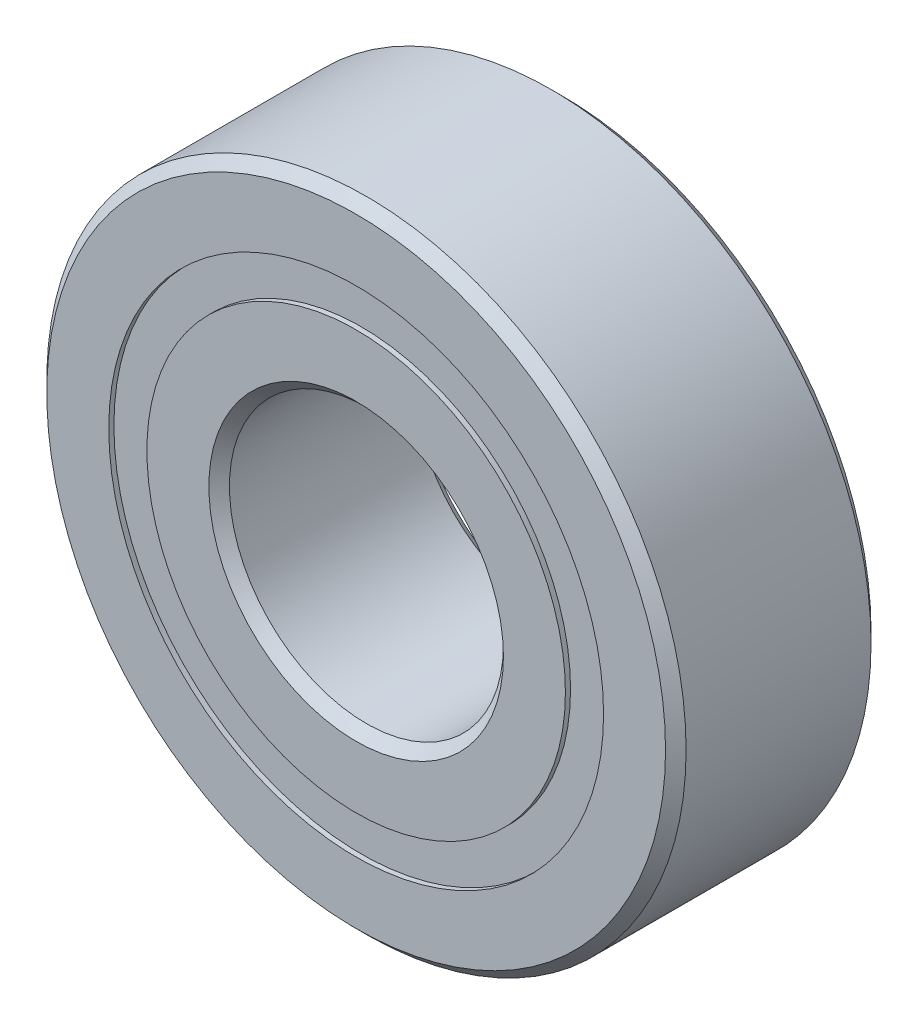
ISO-10303-21;
HEADER;
FILE_DESCRIPTION(('STEP AP214'),'2;1');
FILE_NAME('part.step','',(''),(''),'','','');
FILE_SCHEMA(('AUTOMOTIVE_DESIGN { 1 0 10303 214 1 1 1 1 }'));
ENDSEC;
DATA;
#1=APPLICATION_CONTEXT('core data for automotive mechanical design processes');
#2=APPLICATION_PROTOCOL_DEFINITION('international standard','automotive_design',2000,#1);
#3=PRODUCT_CONTEXT('',#1,'mechanical');
#4=PRODUCT('Part','Part','',(#3));
#5=PRODUCT_RELATED_PRODUCT_CATEGORY('part','',(#4));
#6=PRODUCT_DEFINITION_FORMATION('','',#4);
#7=PRODUCT_DEFINITION_CONTEXT('part definition',#1,'design');
#8=PRODUCT_DEFINITION('design','',#6,#7);
#9=PRODUCT_DEFINITION_SHAPE('','',#8);
#10=(LENGTH_UNIT() NAMED_UNIT(*) SI_UNIT(.MILLI.,.METRE.));
#11=(NAMED_UNIT(*) PLANE_ANGLE_UNIT() SI_UNIT($,.RADIAN.));
#12=(NAMED_UNIT(*) SI_UNIT($,.STERADIAN.) SOLID_ANGLE_UNIT());
#13=UNCERTAINTY_MEASURE_WITH_UNIT(LENGTH_MEASURE(1.E-05),#10,'distance_accuracy_value','');
#14=(GEOMETRIC_REPRESENTATION_CONTEXT(3) GLOBAL_UNCERTAINTY_ASSIGNED_CONTEXT((#13)) GLOBAL_UNIT_ASSIGNED_CONTEXT((#10,
#11,#12)) REPRESENTATION_CONTEXT('',''));
#15=CARTESIAN_POINT('',(0.,0.,0.));
#16=DIRECTION('',(0.,0.,1.));
#17=DIRECTION('',(1.,0.,0.));
#18=AXIS2_PLACEMENT_3D('',#15,#16,#17);
#19=CARTESIAN_POINT('',(0.,8.60041208791209,-3.39328125));
#20=DIRECTION('',(0.,0.,1.));
#21=DIRECTION('',(1.,0.,0.));
#22=AXIS2_PLACEMENT_3D('',#19,#20,#21);
#23=PLANE('',#22);
#24=CARTESIAN_POINT('',(0.,0.,-3.39328125));
#25=DIRECTION('',(0.,0.,1.));
#26=DIRECTION('',(1.,0.,0.));
#27=AXIS2_PLACEMENT_3D('',#24,#25,#26);
#28=CIRCLE('',#27,8.60041208791209);
#29=CARTESIAN_POINT('',(8.60041208791209,0.,-3.39328125));
#30=VERTEX_POINT('',#29);
#31=EDGE_CURVE('E59',#30,#30,#28,.T.);
#32=ORIENTED_EDGE('',*,*,#31,.F.);
#33=EDGE_LOOP('',(#32));
#34=FACE_BOUND('',#33,.T.);
#35=CARTESIAN_POINT('',(0.,0.,-3.39328125));
#36=DIRECTION('',(0.,0.,1.));
#37=DIRECTION('',(1.,0.,0.));
#38=AXIS2_PLACEMENT_3D('',#35,#36,#37);
#39=CIRCLE('',#38,7.27458791208791);
#40=CARTESIAN_POINT('',(7.27458791208791,0.,-3.39328125));
#41=VERTEX_POINT('',#40);
#42=EDGE_CURVE('E11',#41,#41,#39,.T.);
#43=ORIENTED_EDGE('',*,*,#42,.T.);
#44=EDGE_LOOP('',(#43));
#45=FACE_BOUND('',#44,.T.);
#46=ADVANCED_FACE('F45',(#34,#45),#23,.F.);
#47=CARTESIAN_POINT('',(0.,0.,3.571875));
#48=DIRECTION('',(0.,0.,1.));
#49=DIRECTION('',(1.,0.,0.));
#50=AXIS2_PLACEMENT_3D('',#47,#48,#49);
#51=CYLINDRICAL_SURFACE('',#50,7.27458791208791);
#52=ORIENTED_EDGE('',*,*,#42,.F.);
#53=EDGE_LOOP('',(#52));
#54=FACE_BOUND('',#53,.T.);
#55=CARTESIAN_POINT('',(0.,0.,-1.72035132641562));
#56=DIRECTION('',(0.,0.,1.));
#57=DIRECTION('',(1.,0.,0.));
#58=AXIS2_PLACEMENT_3D('',#55,#56,#57);
#59=CIRCLE('',#58,7.27458791208791);
#60=CARTESIAN_POINT('',(7.27458791208791,0.,-1.72035132641562));
#61=VERTEX_POINT('',#60);
#62=EDGE_CURVE('E51',#61,#61,#59,.T.);
#63=ORIENTED_EDGE('',*,*,#62,.T.);
#64=EDGE_LOOP('',(#63));
#65=FACE_BOUND('',#64,.T.);
#66=ADVANCED_FACE('F68',(#54,#65),#51,.F.);
#67=CARTESIAN_POINT('',(0.,8.60041208791209,-1.72035132641562));
#68=DIRECTION('',(0.,0.,-1.));
#69=DIRECTION('',(-1.,0.,0.));
#70=AXIS2_PLACEMENT_3D('',#67,#68,#69);
#71=PLANE('',#70);
#72=ORIENTED_EDGE('',*,*,#62,.F.);
#73=EDGE_LOOP('',(#72));
#74=FACE_BOUND('',#73,.T.);
#75=CARTESIAN_POINT('',(0.,0.,-1.72035132641562));
#76=DIRECTION('',(0.,0.,1.));
#77=DIRECTION('',(1.,0.,0.));
#78=AXIS2_PLACEMENT_3D('',#75,#76,#77);
#79=CIRCLE('',#78,8.60041208791209);
#80=CARTESIAN_POINT('',(8.60041208791209,0.,-1.72035132641562));
#81=VERTEX_POINT('',#80);
#82=EDGE_CURVE('E55',#81,#81,#79,.T.);
#83=ORIENTED_EDGE('',*,*,#82,.T.);
#84=EDGE_LOOP('',(#83));
#85=FACE_BOUND('',#84,.T.);
#86=ADVANCED_FACE('F72',(#74,#85),#71,.F.);
#87=CARTESIAN_POINT('',(0.,0.,3.571875));
#88=DIRECTION('',(0.,0.,1.));
#89=DIRECTION('',(1.,0.,0.));
#90=AXIS2_PLACEMENT_3D('',#87,#88,#89);
#91=CYLINDRICAL_SURFACE('',#90,8.60041208791209);
#92=ORIENTED_EDGE('',*,*,#82,.F.);
#93=EDGE_LOOP('',(#92));
#94=FACE_BOUND('',#93,.T.);
#95=ORIENTED_EDGE('',*,*,#31,.T.);
#96=EDGE_LOOP('',(#95));
#97=FACE_BOUND('',#96,.T.);
#98=ADVANCED_FACE('F65',(#94,#97),#91,.T.);
#99=CLOSED_SHELL('',(#46,#66,#86,#98));
#100=MANIFOLD_SOLID_BREP('B2',#99);
#101=CARTESIAN_POINT('',(0.,8.60041208791209,3.39328125));
#102=DIRECTION('',(0.,0.,-1.));
#103=DIRECTION('',(-1.,0.,0.));
#104=AXIS2_PLACEMENT_3D('',#101,#102,#103);
#105=PLANE('',#104);
#106=CARTESIAN_POINT('',(0.,0.,3.39328125));
#107=DIRECTION('',(0.,0.,1.));
#108=DIRECTION('',(1.,0.,0.));
#109=AXIS2_PLACEMENT_3D('',#106,#107,#108);
#110=CIRCLE('',#109,7.27458791208791);
#111=CARTESIAN_POINT('',(7.27458791208791,0.,3.39328125));
#112=VERTEX_POINT('',#111);
#113=EDGE_CURVE('E44',#112,#112,#110,.T.);
#114=ORIENTED_EDGE('',*,*,#113,.F.);
#115=EDGE_LOOP('',(#114));
#116=FACE_BOUND('',#115,.T.);
#117=CARTESIAN_POINT('',(0.,0.,3.39328125));
#118=DIRECTION('',(0.,0.,1.));
#119=DIRECTION('',(1.,0.,0.));
#120=AXIS2_PLACEMENT_3D('',#117,#118,#119);
#121=CIRCLE('',#120,8.60041208791209);
#122=CARTESIAN_POINT('',(8.60041208791209,0.,3.39328125));
#123=VERTEX_POINT('',#122);
#124=EDGE_CURVE('E126',#123,#123,#121,.T.);
#125=ORIENTED_EDGE('',*,*,#124,.T.);
#126=EDGE_LOOP('',(#125));
#127=FACE_BOUND('',#126,.T.);
#128=ADVANCED_FACE('F112',(#116,#127),#105,.F.);
#129=CARTESIAN_POINT('',(0.,0.,3.571875));
#130=DIRECTION('',(0.,0.,1.));
#131=DIRECTION('',(1.,0.,0.));
#132=AXIS2_PLACEMENT_3D('',#129,#130,#131);
#133=CYLINDRICAL_SURFACE('',#132,7.27458791208791);
#134=CARTESIAN_POINT('',(0.,0.,1.72035132641561));
#135=DIRECTION('',(0.,0.,1.));
#136=DIRECTION('',(1.,0.,0.));
#137=AXIS2_PLACEMENT_3D('',#134,#135,#136);
#138=CIRCLE('',#137,7.27458791208791);
#139=CARTESIAN_POINT('',(7.27458791208791,0.,1.72035132641561));
#140=VERTEX_POINT('',#139);
#141=EDGE_CURVE('E118',#140,#140,#138,.T.);
#142=ORIENTED_EDGE('',*,*,#141,.F.);
#143=EDGE_LOOP('',(#142));
#144=FACE_BOUND('',#143,.T.);
#145=ORIENTED_EDGE('',*,*,#113,.T.);
#146=EDGE_LOOP('',(#145));
#147=FACE_BOUND('',#146,.T.);
#148=ADVANCED_FACE('F141',(#144,#147),#133,.F.);
#149=CARTESIAN_POINT('',(0.,8.60041208791209,1.72035132641561));
#150=DIRECTION('',(0.,0.,1.));
#151=DIRECTION('',(1.,0.,0.));
#152=AXIS2_PLACEMENT_3D('',#149,#150,#151);
#153=PLANE('',#152);
#154=CARTESIAN_POINT('',(0.,0.,1.72035132641561));
#155=DIRECTION('',(0.,0.,1.));
#156=DIRECTION('',(1.,0.,0.));
#157=AXIS2_PLACEMENT_3D('',#154,#155,#156);
#158=CIRCLE('',#157,8.60041208791209);
#159=CARTESIAN_POINT('',(8.60041208791209,0.,1.72035132641561));
#160=VERTEX_POINT('',#159);
#161=EDGE_CURVE('E122',#160,#160,#158,.T.);
#162=ORIENTED_EDGE('',*,*,#161,.F.);
#163=EDGE_LOOP('',(#162));
#164=FACE_BOUND('',#163,.T.);
#165=ORIENTED_EDGE('',*,*,#141,.T.);
#166=EDGE_LOOP('',(#165));
#167=FACE_BOUND('',#166,.T.);
#168=ADVANCED_FACE('F136',(#164,#167),#153,.F.);
#169=CARTESIAN_POINT('',(0.,0.,3.571875));
#170=DIRECTION('',(0.,0.,1.));
#171=DIRECTION('',(1.,0.,0.));
#172=AXIS2_PLACEMENT_3D('',#169,#170,#171);
#173=CYLINDRICAL_SURFACE('',#172,8.60041208791209);
#174=ORIENTED_EDGE('',*,*,#124,.F.);
#175=EDGE_LOOP('',(#174));
#176=FACE_BOUND('',#175,.T.);
#177=ORIENTED_EDGE('',*,*,#161,.T.);
#178=EDGE_LOOP('',(#177));
#179=FACE_BOUND('',#178,.T.);
#180=ADVANCED_FACE('F133',(#176,#179),#173,.T.);
#181=CLOSED_SHELL('',(#128,#148,#168,#180));
#182=MANIFOLD_SOLID_BREP('B6',#181);
#183=CARTESIAN_POINT('',(-4.66554544007142,6.42157239285121,0.));
#184=DIRECTION('',(0.,0.,1.));
#185=DIRECTION('',(-0.587785252292462,0.809016994374955,0.));
#186=AXIS2_PLACEMENT_3D('',#183,#184,#185);
#187=SPHERICAL_SURFACE('',#186,1.72035132641561);
#188=CARTESIAN_POINT('',(-4.66554544007142,6.42157239285121,1.72035132641561));
#189=VERTEX_POINT('',#188);
#190=VERTEX_LOOP('',#189);
#191=FACE_BOUND('',#190,.T.);
#192=ADVANCED_FACE('F179',(#191),#187,.T.);
#193=CLOSED_SHELL('',(#192));
#194=MANIFOLD_SOLID_BREP('B39',#193);
#195=CARTESIAN_POINT('',(-7.54901109809275,2.45282239285123,0.));
#196=DIRECTION('',(0.,0.,1.));
#197=DIRECTION('',(-0.95105651629515,0.309016994374958,0.));
#198=AXIS2_PLACEMENT_3D('',#195,#196,#197);
#199=SPHERICAL_SURFACE('',#198,1.72035132641561);
#200=CARTESIAN_POINT('',(-7.54901109809275,2.45282239285123,1.72035132641561));
#201=VERTEX_POINT('',#200);
#202=VERTEX_LOOP('',#201);
#203=FACE_BOUND('',#202,.T.);
#204=ADVANCED_FACE('F199',(#203),#199,.T.);
#205=CLOSED_SHELL('',(#204));
#206=MANIFOLD_SOLID_BREP('B108',#205);
#207=CARTESIAN_POINT('',(-7.54901109809281,-2.45282239285107,0.));
#208=DIRECTION('',(0.,0.,1.));
#209=DIRECTION('',(-0.951056516295157,-0.309016994374938,0.));
#210=AXIS2_PLACEMENT_3D('',#207,#208,#209);
#211=SPHERICAL_SURFACE('',#210,1.72035132641561);
#212=CARTESIAN_POINT('',(-7.54901109809281,-2.45282239285107,1.72035132641561));
#213=VERTEX_POINT('',#212);
#214=VERTEX_LOOP('',#213);
#215=FACE_BOUND('',#214,.T.);
#216=ADVANCED_FACE('F219',(#215),#211,.T.);
#217=CLOSED_SHELL('',(#216));
#218=MANIFOLD_SOLID_BREP('B175',#217);
#219=CARTESIAN_POINT('',(-4.66554544007156,-6.4215723928511,0.));
#220=DIRECTION('',(0.,0.,1.));
#221=DIRECTION('',(-0.58778525229248,-0.809016994374942,0.));
#222=AXIS2_PLACEMENT_3D('',#219,#220,#221);
#223=SPHERICAL_SURFACE('',#222,1.72035132641561);
#224=CARTESIAN_POINT('',(-4.66554544007156,-6.4215723928511,1.72035132641561));
#225=VERTEX_POINT('',#224);
#226=VERTEX_LOOP('',#225);
#227=FACE_BOUND('',#226,.T.);
#228=ADVANCED_FACE('F239',(#227),#223,.T.);
#229=CLOSED_SHELL('',(#228));
#230=MANIFOLD_SOLID_BREP('B195',#229);
#231=CARTESIAN_POINT('',(0.,-7.9375,0.));
#232=DIRECTION('',(0.,0.,1.));
#233=DIRECTION('',(0.,-1.,0.));
#234=AXIS2_PLACEMENT_3D('',#231,#232,#233);
#235=SPHERICAL_SURFACE('',#234,1.72035132641561);
#236=CARTESIAN_POINT('',(0.,-7.9375,1.72035132641561));
#237=VERTEX_POINT('',#236);
#238=VERTEX_LOOP('',#237);
#239=FACE_BOUND('',#238,.T.);
#240=ADVANCED_FACE('F259',(#239),#235,.T.);
#241=CLOSED_SHELL('',(#240));
#242=MANIFOLD_SOLID_BREP('B215',#241);
#243=CARTESIAN_POINT('',(4.66554544007147,-6.42157239285117,0.));
#244=DIRECTION('',(0.,0.,1.));
#245=DIRECTION('',(0.587785252292469,-0.809016994374951,0.));
#246=AXIS2_PLACEMENT_3D('',#243,#244,#245);
#247=SPHERICAL_SURFACE('',#246,1.72035132641561);
#248=CARTESIAN_POINT('',(4.66554544007147,-6.42157239285117,1.72035132641561));
#249=VERTEX_POINT('',#248);
#250=VERTEX_LOOP('',#249);
#251=FACE_BOUND('',#250,.T.);
#252=ADVANCED_FACE('F279',(#251),#247,.T.);
#253=CLOSED_SHELL('',(#252));
#254=MANIFOLD_SOLID_BREP('B235',#253);
#255=CARTESIAN_POINT('',(7.54901109809277,-2.45282239285118,0.));
#256=DIRECTION('',(0.,0.,1.));
#257=DIRECTION('',(0.951056516295152,-0.309016994374952,0.));
#258=AXIS2_PLACEMENT_3D('',#255,#256,#257);
#259=SPHERICAL_SURFACE('',#258,1.72035132641561);
#260=CARTESIAN_POINT('',(7.54901109809277,-2.45282239285118,1.72035132641561));
#261=VERTEX_POINT('',#260);
#262=VERTEX_LOOP('',#261);
#263=FACE_BOUND('',#262,.T.);
#264=ADVANCED_FACE('F299',(#263),#259,.T.);
#265=CLOSED_SHELL('',(#264));
#266=MANIFOLD_SOLID_BREP('B255',#265);
#267=CARTESIAN_POINT('',(7.54901109809279,2.45282239285112,0.));
#268=DIRECTION('',(0.,0.,1.));
#269=DIRECTION('',(0.951056516295155,0.309016994374945,0.));
#270=AXIS2_PLACEMENT_3D('',#267,#268,#269);
#271=SPHERICAL_SURFACE('',#270,1.72035132641561);
#272=CARTESIAN_POINT('',(7.54901109809279,2.45282239285112,1.72035132641561));
#273=VERTEX_POINT('',#272);
#274=VERTEX_LOOP('',#273);
#275=FACE_BOUND('',#274,.T.);
#276=ADVANCED_FACE('F319',(#275),#271,.T.);
#277=CLOSED_SHELL('',(#276));
#278=MANIFOLD_SOLID_BREP('B275',#277);
#279=CARTESIAN_POINT('',(4.66554544007152,6.42157239285114,0.));
#280=DIRECTION('',(0.,0.,1.));
#281=DIRECTION('',(0.587785252292474,0.809016994374947,0.));
#282=AXIS2_PLACEMENT_3D('',#279,#280,#281);
#283=SPHERICAL_SURFACE('',#282,1.72035132641561);
#284=CARTESIAN_POINT('',(4.66554544007152,6.42157239285114,1.72035132641561));
#285=VERTEX_POINT('',#284);
#286=VERTEX_LOOP('',#285);
#287=FACE_BOUND('',#286,.T.);
#288=ADVANCED_FACE('F339',(#287),#283,.T.);
#289=CLOSED_SHELL('',(#288));
#290=MANIFOLD_SOLID_BREP('B295',#289);
#291=CARTESIAN_POINT('',(0.,7.9375,0.));
#292=DIRECTION('',(0.,0.,1.));
#293=DIRECTION('',(0.,1.,0.));
#294=AXIS2_PLACEMENT_3D('',#291,#292,#293);
#295=SPHERICAL_SURFACE('',#294,1.72035132641561);
#296=CARTESIAN_POINT('',(0.,7.9375,1.72035132641561));
#297=VERTEX_POINT('',#296);
#298=VERTEX_LOOP('',#297);
#299=FACE_BOUND('',#298,.T.);
#300=ADVANCED_FACE('F361',(#299),#295,.T.);
#301=CLOSED_SHELL('',(#300));
#302=MANIFOLD_SOLID_BREP('B315',#301);
#303=CARTESIAN_POINT('',(0.,7.27458791208791,3.571875));
#304=DIRECTION('',(0.,0.,-1.));
#305=DIRECTION('',(-1.,0.,0.));
#306=AXIS2_PLACEMENT_3D('',#303,#304,#305);
#307=PLANE('',#306);
#308=CARTESIAN_POINT('',(0.,0.,3.571875));
#309=DIRECTION('',(0.,0.,1.));
#310=DIRECTION('',(1.,0.,0.));
#311=AXIS2_PLACEMENT_3D('',#308,#309,#310);
#312=CIRCLE('',#311,5.1196875);
#313=CARTESIAN_POINT('',(5.1196875,0.,3.571875));
#314=VERTEX_POINT('',#313);
#315=EDGE_CURVE('E408',#314,#314,#312,.T.);
#316=ORIENTED_EDGE('',*,*,#315,.F.);
#317=EDGE_LOOP('',(#316));
#318=FACE_BOUND('',#317,.T.);
#319=CARTESIAN_POINT('',(0.,0.,3.571875));
#320=DIRECTION('',(0.,0.,1.));
#321=DIRECTION('',(1.,0.,0.));
#322=AXIS2_PLACEMENT_3D('',#319,#320,#321);
#323=CIRCLE('',#322,7.27458791208791);
#324=CARTESIAN_POINT('',(7.27458791208791,0.,3.571875));
#325=VERTEX_POINT('',#324);
#326=EDGE_CURVE('E360',#325,#325,#323,.T.);
#327=ORIENTED_EDGE('',*,*,#326,.T.);
#328=EDGE_LOOP('',(#327));
#329=FACE_BOUND('',#328,.T.);
#330=ADVANCED_FACE('F380',(#318,#329),#307,.F.);
#331=CARTESIAN_POINT('',(0.,0.,3.571875));
#332=DIRECTION('',(0.,0.,1.));
#333=DIRECTION('',(1.,0.,0.));
#334=AXIS2_PLACEMENT_3D('',#331,#332,#333);
#335=CYLINDRICAL_SURFACE('',#334,7.27458791208791);
#336=ORIENTED_EDGE('',*,*,#326,.F.);
#337=EDGE_LOOP('',(#336));
#338=FACE_BOUND('',#337,.T.);
#339=CARTESIAN_POINT('',(0.,0.,1.5875));
#340=DIRECTION('',(0.,0.,1.));
#341=DIRECTION('',(1.,0.,0.));
#342=AXIS2_PLACEMENT_3D('',#339,#340,#341);
#343=CIRCLE('',#342,7.27458791208791);
#344=CARTESIAN_POINT('',(7.27458791208791,0.,1.5875));
#345=VERTEX_POINT('',#344);
#346=EDGE_CURVE('E386',#345,#345,#343,.T.);
#347=ORIENTED_EDGE('',*,*,#346,.T.);
#348=EDGE_LOOP('',(#347));
#349=FACE_BOUND('',#348,.T.);
#350=ADVANCED_FACE('F415',(#338,#349),#335,.T.);
#351=CARTESIAN_POINT('',(0.,0.,0.));
#352=DIRECTION('',(0.,0.,1.));
#353=DIRECTION('',(1.,0.,0.));
#354=AXIS2_PLACEMENT_3D('',#351,#352,#353);
#355=TOROIDAL_SURFACE('',#354,7.93749999999999,1.72035132641561);
#356=ORIENTED_EDGE('',*,*,#346,.F.);
#357=EDGE_LOOP('',(#356));
#358=FACE_BOUND('',#357,.T.);
#359=CARTESIAN_POINT('',(0.,0.,-1.5875));
#360=DIRECTION('',(0.,0.,1.));
#361=DIRECTION('',(1.,0.,0.));
#362=AXIS2_PLACEMENT_3D('',#359,#360,#361);
#363=CIRCLE('',#362,7.27458791208791);
#364=CARTESIAN_POINT('',(7.27458791208791,0.,-1.5875));
#365=VERTEX_POINT('',#364);
#366=EDGE_CURVE('E390',#365,#365,#363,.T.);
#367=ORIENTED_EDGE('',*,*,#366,.T.);
#368=EDGE_LOOP('',(#367));
#369=FACE_BOUND('',#368,.T.);
#370=ADVANCED_FACE('F419',(#358,#369),#355,.F.);
#371=CARTESIAN_POINT('',(0.,0.,3.571875));
#372=DIRECTION('',(0.,0.,1.));
#373=DIRECTION('',(1.,0.,0.));
#374=AXIS2_PLACEMENT_3D('',#371,#372,#373);
#375=CYLINDRICAL_SURFACE('',#374,7.27458791208791);
#376=ORIENTED_EDGE('',*,*,#366,.F.);
#377=EDGE_LOOP('',(#376));
#378=FACE_BOUND('',#377,.T.);
#379=CARTESIAN_POINT('',(0.,0.,-3.571875));
#380=DIRECTION('',(0.,0.,1.));
#381=DIRECTION('',(1.,0.,0.));
#382=AXIS2_PLACEMENT_3D('',#379,#380,#381);
#383=CIRCLE('',#382,7.27458791208791);
#384=CARTESIAN_POINT('',(7.27458791208791,0.,-3.571875));
#385=VERTEX_POINT('',#384);
#386=EDGE_CURVE('E394',#385,#385,#383,.T.);
#387=ORIENTED_EDGE('',*,*,#386,.T.);
#388=EDGE_LOOP('',(#387));
#389=FACE_BOUND('',#388,.T.);
#390=ADVANCED_FACE('F424',(#378,#389),#375,.T.);
#391=CARTESIAN_POINT('',(0.,5.1196875,-3.571875));
#392=DIRECTION('',(0.,0.,1.));
#393=DIRECTION('',(1.,0.,0.));
#394=AXIS2_PLACEMENT_3D('',#391,#392,#393);
#395=PLANE('',#394);
#396=ORIENTED_EDGE('',*,*,#386,.F.);
#397=EDGE_LOOP('',(#396));
#398=FACE_BOUND('',#397,.T.);
#399=CARTESIAN_POINT('',(0.,0.,-3.571875));
#400=DIRECTION('',(0.,0.,1.));
#401=DIRECTION('',(1.,0.,0.));
#402=AXIS2_PLACEMENT_3D('',#399,#400,#401);
#403=CIRCLE('',#402,5.1196875);
#404=CARTESIAN_POINT('',(5.1196875,0.,-3.571875));
#405=VERTEX_POINT('',#404);
#406=EDGE_CURVE('E399',#405,#405,#403,.T.);
#407=ORIENTED_EDGE('',*,*,#406,.T.);
#408=EDGE_LOOP('',(#407));
#409=FACE_BOUND('',#408,.T.);
#410=ADVANCED_FACE('F430',(#398,#409),#395,.F.);
#411=CARTESIAN_POINT('',(0.,0.,-3.2146875));
#412=DIRECTION('',(0.,0.,-1.));
#413=DIRECTION('',(-1.,0.,0.));
#414=AXIS2_PLACEMENT_3D('',#411,#412,#413);
#415=CONICAL_SURFACE('',#414,4.7625,0.785398163397444);
#416=ORIENTED_EDGE('',*,*,#406,.F.);
#417=EDGE_LOOP('',(#416));
#418=FACE_BOUND('',#417,.T.);
#419=CARTESIAN_POINT('',(0.,0.,-3.2146875));
#420=DIRECTION('',(0.,0.,1.));
#421=DIRECTION('',(1.,0.,0.));
#422=AXIS2_PLACEMENT_3D('',#419,#420,#421);
#423=CIRCLE('',#422,4.7625);
#424=CARTESIAN_POINT('',(4.7625,0.,-3.2146875));
#425=VERTEX_POINT('',#424);
#426=EDGE_CURVE('E402',#425,#425,#423,.T.);
#427=ORIENTED_EDGE('',*,*,#426,.T.);
#428=EDGE_LOOP('',(#427));
#429=FACE_BOUND('',#428,.T.);
#430=ADVANCED_FACE('F434',(#418,#429),#415,.F.);
#431=CARTESIAN_POINT('',(0.,0.,3.571875));
#432=DIRECTION('',(0.,0.,1.));
#433=DIRECTION('',(1.,0.,0.));
#434=AXIS2_PLACEMENT_3D('',#431,#432,#433);
#435=CYLINDRICAL_SURFACE('',#434,4.7625);
#436=ORIENTED_EDGE('',*,*,#426,.F.);
#437=EDGE_LOOP('',(#436));
#438=FACE_BOUND('',#437,.T.);
#439=CARTESIAN_POINT('',(0.,0.,3.2146875));
#440=DIRECTION('',(0.,0.,1.));
#441=DIRECTION('',(1.,0.,0.));
#442=AXIS2_PLACEMENT_3D('',#439,#440,#441);
#443=CIRCLE('',#442,4.7625);
#444=CARTESIAN_POINT('',(4.7625,0.,3.2146875));
#445=VERTEX_POINT('',#444);
#446=EDGE_CURVE('E405',#445,#445,#443,.T.);
#447=ORIENTED_EDGE('',*,*,#446,.T.);
#448=EDGE_LOOP('',(#447));
#449=FACE_BOUND('',#448,.T.);
#450=ADVANCED_FACE('F438',(#438,#449),#435,.F.);
#451=CARTESIAN_POINT('',(0.,0.,3.571875));
#452=DIRECTION('',(0.,0.,1.));
#453=DIRECTION('',(1.,0.,0.));
#454=AXIS2_PLACEMENT_3D('',#451,#452,#453);
#455=CONICAL_SURFACE('',#454,5.1196875,0.785398163397453);
#456=ORIENTED_EDGE('',*,*,#446,.F.);
#457=EDGE_LOOP('',(#456));
#458=FACE_BOUND('',#457,.T.);
#459=ORIENTED_EDGE('',*,*,#315,.T.);
#460=EDGE_LOOP('',(#459));
#461=FACE_BOUND('',#460,.T.);
#462=ADVANCED_FACE('F412',(#458,#461),#455,.F.);
#463=CLOSED_SHELL('',(#330,#350,#370,#390,#410,#430,#450,#462));
#464=MANIFOLD_SOLID_BREP('B335',#463);
#465=CARTESIAN_POINT('',(0.,0.,3.2146875));
#466=DIRECTION('',(0.,0.,-1.));
#467=DIRECTION('',(-1.,0.,0.));
#468=AXIS2_PLACEMENT_3D('',#465,#466,#467);
#469=CONICAL_SURFACE('',#468,11.1125,0.785398163397446);
#470=CARTESIAN_POINT('',(0.,0.,3.571875));
#471=DIRECTION('',(0.,0.,1.));
#472=DIRECTION('',(1.,0.,0.));
#473=AXIS2_PLACEMENT_3D('',#470,#471,#472);
#474=CIRCLE('',#473,10.7553125);
#475=CARTESIAN_POINT('',(10.7553125,0.,3.571875));
#476=VERTEX_POINT('',#475);
#477=EDGE_CURVE('E529',#476,#476,#474,.T.);
#478=ORIENTED_EDGE('',*,*,#477,.F.);
#479=EDGE_LOOP('',(#478));
#480=FACE_BOUND('',#479,.T.);
#481=CARTESIAN_POINT('',(0.,0.,3.2146875));
#482=DIRECTION('',(0.,0.,1.));
#483=DIRECTION('',(1.,0.,0.));
#484=AXIS2_PLACEMENT_3D('',#481,#482,#483);
#485=CIRCLE('',#484,11.1125);
#486=CARTESIAN_POINT('',(11.1125,0.,3.2146875));
#487=VERTEX_POINT('',#486);
#488=EDGE_CURVE('E379',#487,#487,#485,.T.);
#489=ORIENTED_EDGE('',*,*,#488,.T.);
#490=EDGE_LOOP('',(#489));
#491=FACE_BOUND('',#490,.T.);
#492=ADVANCED_FACE('F501',(#480,#491),#469,.T.);
#493=CARTESIAN_POINT('',(0.,0.,3.571875));
#494=DIRECTION('',(0.,0.,1.));
#495=DIRECTION('',(1.,0.,0.));
#496=AXIS2_PLACEMENT_3D('',#493,#494,#495);
#497=CYLINDRICAL_SURFACE('',#496,11.1125);
#498=ORIENTED_EDGE('',*,*,#488,.F.);
#499=EDGE_LOOP('',(#498));
#500=FACE_BOUND('',#499,.T.);
#501=CARTESIAN_POINT('',(0.,0.,-3.2146875));
#502=DIRECTION('',(0.,0.,1.));
#503=DIRECTION('',(1.,0.,0.));
#504=AXIS2_PLACEMENT_3D('',#501,#502,#503);
#505=CIRCLE('',#504,11.1125);
#506=CARTESIAN_POINT('',(11.1125,0.,-3.2146875));
#507=VERTEX_POINT('',#506);
#508=EDGE_CURVE('E507',#507,#507,#505,.T.);
#509=ORIENTED_EDGE('',*,*,#508,.T.);
#510=EDGE_LOOP('',(#509));
#511=FACE_BOUND('',#510,.T.);
#512=ADVANCED_FACE('F536',(#500,#511),#497,.T.);
#513=CARTESIAN_POINT('',(0.,0.,-3.571875));
#514=DIRECTION('',(0.,0.,1.));
#515=DIRECTION('',(1.,0.,0.));
#516=AXIS2_PLACEMENT_3D('',#513,#514,#515);
#517=CONICAL_SURFACE('',#516,10.7553125,0.785398163397444);
#518=ORIENTED_EDGE('',*,*,#508,.F.);
#519=EDGE_LOOP('',(#518));
#520=FACE_BOUND('',#519,.T.);
#521=CARTESIAN_POINT('',(0.,0.,-3.571875));
#522=DIRECTION('',(0.,0.,1.));
#523=DIRECTION('',(1.,0.,0.));
#524=AXIS2_PLACEMENT_3D('',#521,#522,#523);
#525=CIRCLE('',#524,10.7553125);
#526=CARTESIAN_POINT('',(10.7553125,0.,-3.571875));
#527=VERTEX_POINT('',#526);
#528=EDGE_CURVE('E511',#527,#527,#525,.T.);
#529=ORIENTED_EDGE('',*,*,#528,.T.);
#530=EDGE_LOOP('',(#529));
#531=FACE_BOUND('',#530,.T.);
#532=ADVANCED_FACE('F540',(#520,#531),#517,.T.);
#533=CARTESIAN_POINT('',(0.,10.7553125,-3.571875));
#534=DIRECTION('',(0.,0.,1.));
#535=DIRECTION('',(1.,0.,0.));
#536=AXIS2_PLACEMENT_3D('',#533,#534,#535);
#537=PLANE('',#536);
#538=ORIENTED_EDGE('',*,*,#528,.F.);
#539=EDGE_LOOP('',(#538));
#540=FACE_BOUND('',#539,.T.);
#541=CARTESIAN_POINT('',(0.,0.,-3.571875));
#542=DIRECTION('',(0.,0.,1.));
#543=DIRECTION('',(1.,0.,0.));
#544=AXIS2_PLACEMENT_3D('',#541,#542,#543);
#545=CIRCLE('',#544,8.60041208791209);
#546=CARTESIAN_POINT('',(8.60041208791209,0.,-3.571875));
#547=VERTEX_POINT('',#546);
#548=EDGE_CURVE('E515',#547,#547,#545,.T.);
#549=ORIENTED_EDGE('',*,*,#548,.T.);
#550=EDGE_LOOP('',(#549));
#551=FACE_BOUND('',#550,.T.);
#552=ADVANCED_FACE('F545',(#540,#551),#537,.F.);
#553=CARTESIAN_POINT('',(0.,0.,3.571875));
#554=DIRECTION('',(0.,0.,1.));
#555=DIRECTION('',(1.,0.,0.));
#556=AXIS2_PLACEMENT_3D('',#553,#554,#555);
#557=CYLINDRICAL_SURFACE('',#556,8.60041208791209);
#558=ORIENTED_EDGE('',*,*,#548,.F.);
#559=EDGE_LOOP('',(#558));
#560=FACE_BOUND('',#559,.T.);
#561=CARTESIAN_POINT('',(0.,0.,-1.5875));
#562=DIRECTION('',(0.,0.,1.));
#563=DIRECTION('',(1.,0.,0.));
#564=AXIS2_PLACEMENT_3D('',#561,#562,#563);
#565=CIRCLE('',#564,8.60041208791209);
#566=CARTESIAN_POINT('',(8.60041208791209,0.,-1.5875));
#567=VERTEX_POINT('',#566);
#568=EDGE_CURVE('E520',#567,#567,#565,.T.);
#569=ORIENTED_EDGE('',*,*,#568,.T.);
#570=EDGE_LOOP('',(#569));
#571=FACE_BOUND('',#570,.T.);
#572=ADVANCED_FACE('F551',(#560,#571),#557,.F.);
#573=CARTESIAN_POINT('',(0.,0.,0.));
#574=DIRECTION('',(0.,0.,1.));
#575=DIRECTION('',(1.,0.,0.));
#576=AXIS2_PLACEMENT_3D('',#573,#574,#575);
#577=TOROIDAL_SURFACE('',#576,7.9375,1.72035132641561);
#578=ORIENTED_EDGE('',*,*,#568,.F.);
#579=EDGE_LOOP('',(#578));
#580=FACE_BOUND('',#579,.T.);
#581=CARTESIAN_POINT('',(0.,0.,1.5875));
#582=DIRECTION('',(0.,0.,1.));
#583=DIRECTION('',(1.,0.,0.));
#584=AXIS2_PLACEMENT_3D('',#581,#582,#583);
#585=CIRCLE('',#584,8.60041208791209);
#586=CARTESIAN_POINT('',(8.60041208791209,0.,1.5875));
#587=VERTEX_POINT('',#586);
#588=EDGE_CURVE('E523',#587,#587,#585,.T.);
#589=ORIENTED_EDGE('',*,*,#588,.T.);
#590=EDGE_LOOP('',(#589));
#591=FACE_BOUND('',#590,.T.);
#592=ADVANCED_FACE('F555',(#580,#591),#577,.F.);
#593=CARTESIAN_POINT('',(0.,0.,3.571875));
#594=DIRECTION('',(0.,0.,1.));
#595=DIRECTION('',(1.,0.,0.));
#596=AXIS2_PLACEMENT_3D('',#593,#594,#595);
#597=CYLINDRICAL_SURFACE('',#596,8.60041208791209);
#598=ORIENTED_EDGE('',*,*,#588,.F.);
#599=EDGE_LOOP('',(#598));
#600=FACE_BOUND('',#599,.T.);
#601=CARTESIAN_POINT('',(0.,0.,3.571875));
#602=DIRECTION('',(0.,0.,1.));
#603=DIRECTION('',(1.,0.,0.));
#604=AXIS2_PLACEMENT_3D('',#601,#602,#603);
#605=CIRCLE('',#604,8.60041208791209);
#606=CARTESIAN_POINT('',(8.60041208791209,0.,3.571875));
#607=VERTEX_POINT('',#606);
#608=EDGE_CURVE('E526',#607,#607,#605,.T.);
#609=ORIENTED_EDGE('',*,*,#608,.T.);
#610=EDGE_LOOP('',(#609));
#611=FACE_BOUND('',#610,.T.);
#612=ADVANCED_FACE('F559',(#600,#611),#597,.F.);
#613=CARTESIAN_POINT('',(0.,10.7553125,3.571875));
#614=DIRECTION('',(0.,0.,-1.));
#615=DIRECTION('',(-1.,0.,0.));
#616=AXIS2_PLACEMENT_3D('',#613,#614,#615);
#617=PLANE('',#616);
#618=ORIENTED_EDGE('',*,*,#608,.F.);
#619=EDGE_LOOP('',(#618));
#620=FACE_BOUND('',#619,.T.);
#621=ORIENTED_EDGE('',*,*,#477,.T.);
#622=EDGE_LOOP('',(#621));
#623=FACE_BOUND('',#622,.T.);
#624=ADVANCED_FACE('F533',(#620,#623),#617,.F.);
#625=CLOSED_SHELL('',(#492,#512,#532,#552,#572,#592,#612,#624));
#626=MANIFOLD_SOLID_BREP('B355',#625);
#627=ADVANCED_BREP_SHAPE_REPRESENTATION('',(#18,#100,#182,#194,#206,#218,#230,#242,#254,#266,
#278,#290,#302,#464,#626),#14);
#628=SHAPE_DEFINITION_REPRESENTATION(#9,#627);
ENDSEC;
END-ISO-10303-21;
